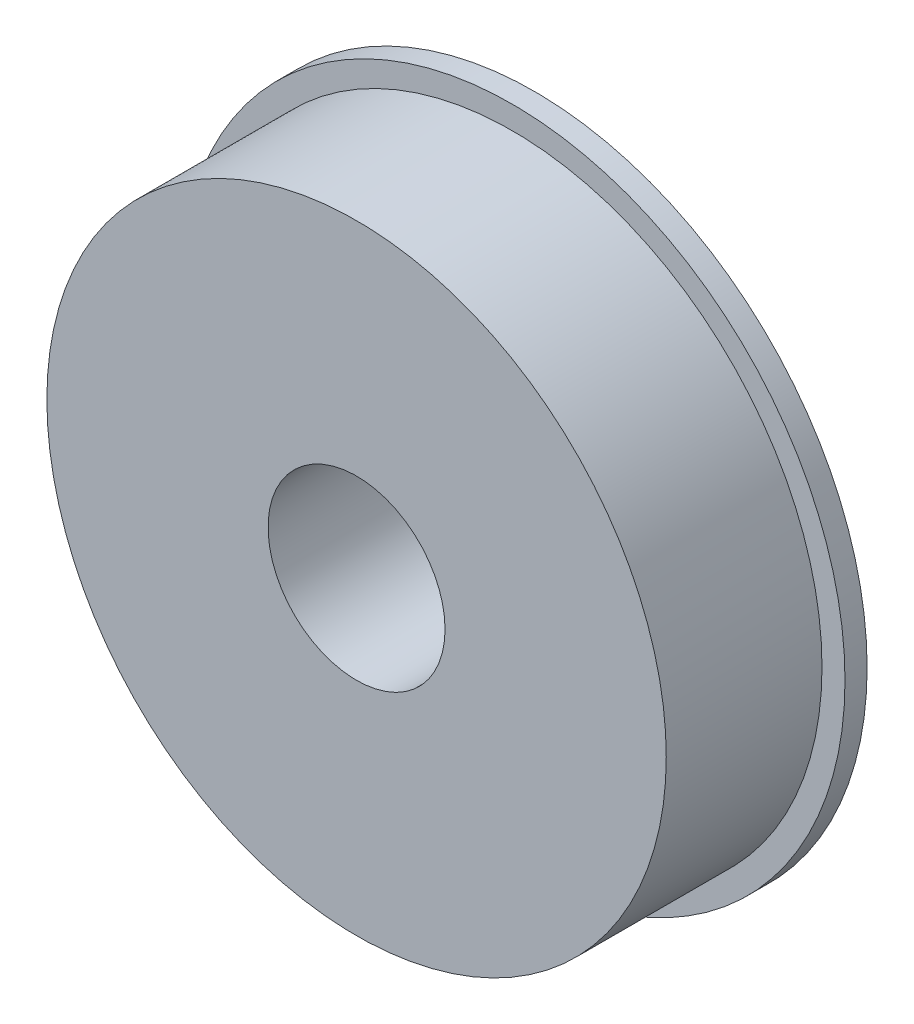
ISO-10303-21;
HEADER;
FILE_DESCRIPTION(('STEP AP214'),'2;1');
FILE_NAME('part.step','',(''),(''),'','','');
FILE_SCHEMA(('AUTOMOTIVE_DESIGN { 1 0 10303 214 1 1 1 1 }'));
ENDSEC;
DATA;
#1=APPLICATION_CONTEXT('core data for automotive mechanical design processes');
#2=APPLICATION_PROTOCOL_DEFINITION('international standard','automotive_design',2000,#1);
#3=PRODUCT_CONTEXT('',#1,'mechanical');
#4=PRODUCT('Part','Part','',(#3));
#5=PRODUCT_RELATED_PRODUCT_CATEGORY('part','',(#4));
#6=PRODUCT_DEFINITION_FORMATION('','',#4);
#7=PRODUCT_DEFINITION_CONTEXT('part definition',#1,'design');
#8=PRODUCT_DEFINITION('design','',#6,#7);
#9=PRODUCT_DEFINITION_SHAPE('','',#8);
#10=(LENGTH_UNIT() NAMED_UNIT(*) SI_UNIT(.MILLI.,.METRE.));
#11=(NAMED_UNIT(*) PLANE_ANGLE_UNIT() SI_UNIT($,.RADIAN.));
#12=(NAMED_UNIT(*) SI_UNIT($,.STERADIAN.) SOLID_ANGLE_UNIT());
#13=UNCERTAINTY_MEASURE_WITH_UNIT(LENGTH_MEASURE(1.E-05),#10,'distance_accuracy_value','');
#14=(GEOMETRIC_REPRESENTATION_CONTEXT(3) GLOBAL_UNCERTAINTY_ASSIGNED_CONTEXT((#13)) GLOBAL_UNIT_ASSIGNED_CONTEXT((#10,
#11,#12)) REPRESENTATION_CONTEXT('',''));
#15=CARTESIAN_POINT('',(0.,0.,0.));
#16=DIRECTION('',(0.,0.,1.));
#17=DIRECTION('',(1.,0.,0.));
#18=AXIS2_PLACEMENT_3D('',#15,#16,#17);
#19=CARTESIAN_POINT('',(0.,0.,1.5875));
#20=DIRECTION('',(0.,0.,1.));
#21=DIRECTION('',(1.,0.,0.));
#22=AXIS2_PLACEMENT_3D('',#19,#20,#21);
#23=PLANE('',#22);
#24=CARTESIAN_POINT('',(0.,0.,1.5875));
#25=DIRECTION('',(0.,0.,1.));
#26=DIRECTION('',(1.,0.,0.));
#27=AXIS2_PLACEMENT_3D('',#24,#25,#26);
#28=CIRCLE('',#27,23.876);
#29=CARTESIAN_POINT('',(23.876,0.,1.5875));
#30=VERTEX_POINT('',#29);
#31=EDGE_CURVE('E10',#30,#30,#28,.T.);
#32=ORIENTED_EDGE('',*,*,#31,.T.);
#33=EDGE_LOOP('',(#32));
#34=FACE_BOUND('',#33,.T.);
#35=CARTESIAN_POINT('',(0.,0.,1.5875));
#36=DIRECTION('',(0.,0.,1.));
#37=DIRECTION('',(1.,0.,0.));
#38=AXIS2_PLACEMENT_3D('',#35,#36,#37);
#39=CIRCLE('',#38,22.225);
#40=CARTESIAN_POINT('',(22.225,0.,1.5875));
#41=VERTEX_POINT('',#40);
#42=EDGE_CURVE('E44',#41,#41,#39,.T.);
#43=ORIENTED_EDGE('',*,*,#42,.F.);
#44=EDGE_LOOP('',(#43));
#45=FACE_BOUND('',#44,.T.);
#46=ADVANCED_FACE('F31',(#34,#45),#23,.T.);
#47=CARTESIAN_POINT('',(0.,0.,1.5875));
#48=DIRECTION('',(0.,0.,-1.));
#49=DIRECTION('',(-1.,0.,0.));
#50=AXIS2_PLACEMENT_3D('',#47,#48,#49);
#51=CYLINDRICAL_SURFACE('',#50,23.876);
#52=ORIENTED_EDGE('',*,*,#31,.F.);
#53=EDGE_LOOP('',(#52));
#54=FACE_BOUND('',#53,.T.);
#55=CARTESIAN_POINT('',(0.,0.,0.));
#56=DIRECTION('',(0.,0.,1.));
#57=DIRECTION('',(1.,0.,0.));
#58=AXIS2_PLACEMENT_3D('',#55,#56,#57);
#59=CIRCLE('',#58,23.876);
#60=CARTESIAN_POINT('',(23.876,0.,0.));
#61=VERTEX_POINT('',#60);
#62=EDGE_CURVE('E35',#61,#61,#59,.T.);
#63=ORIENTED_EDGE('',*,*,#62,.T.);
#64=EDGE_LOOP('',(#63));
#65=FACE_BOUND('',#64,.T.);
#66=ADVANCED_FACE('F33',(#54,#65),#51,.T.);
#67=CARTESIAN_POINT('',(0.,0.,0.));
#68=DIRECTION('',(0.,0.,1.));
#69=DIRECTION('',(1.,0.,0.));
#70=AXIS2_PLACEMENT_3D('',#67,#68,#69);
#71=PLANE('',#70);
#72=ORIENTED_EDGE('',*,*,#62,.F.);
#73=EDGE_LOOP('',(#72));
#74=FACE_BOUND('',#73,.T.);
#75=ADVANCED_FACE('F73',(#74),#71,.F.);
#76=CARTESIAN_POINT('',(0.,0.,12.7635));
#77=DIRECTION('',(0.,0.,-1.));
#78=DIRECTION('',(-1.,0.,0.));
#79=AXIS2_PLACEMENT_3D('',#76,#77,#78);
#80=CYLINDRICAL_SURFACE('',#79,22.225);
#81=CARTESIAN_POINT('',(0.,0.,12.7635));
#82=DIRECTION('',(0.,0.,1.));
#83=DIRECTION('',(1.,0.,0.));
#84=AXIS2_PLACEMENT_3D('',#81,#82,#83);
#85=CIRCLE('',#84,22.225);
#86=CARTESIAN_POINT('',(22.225,0.,12.7635));
#87=VERTEX_POINT('',#86);
#88=EDGE_CURVE('E42',#87,#87,#85,.T.);
#89=ORIENTED_EDGE('',*,*,#88,.F.);
#90=EDGE_LOOP('',(#89));
#91=FACE_BOUND('',#90,.T.);
#92=ORIENTED_EDGE('',*,*,#42,.T.);
#93=EDGE_LOOP('',(#92));
#94=FACE_BOUND('',#93,.T.);
#95=ADVANCED_FACE('F67',(#91,#94),#80,.T.);
#96=CARTESIAN_POINT('',(0.,0.,12.7635));
#97=DIRECTION('',(0.,0.,1.));
#98=DIRECTION('',(1.,0.,0.));
#99=AXIS2_PLACEMENT_3D('',#96,#97,#98);
#100=PLANE('',#99);
#101=CARTESIAN_POINT('',(0.,0.,12.7635));
#102=DIRECTION('',(0.,0.,1.));
#103=DIRECTION('',(1.,0.,0.));
#104=AXIS2_PLACEMENT_3D('',#101,#102,#103);
#105=CIRCLE('',#104,6.35);
#106=CARTESIAN_POINT('',(6.35,0.,12.7635));
#107=VERTEX_POINT('',#106);
#108=EDGE_CURVE('E50',#107,#107,#105,.T.);
#109=ORIENTED_EDGE('',*,*,#108,.F.);
#110=EDGE_LOOP('',(#109));
#111=FACE_BOUND('',#110,.T.);
#112=ORIENTED_EDGE('',*,*,#88,.T.);
#113=EDGE_LOOP('',(#112));
#114=FACE_BOUND('',#113,.T.);
#115=ADVANCED_FACE('F61',(#111,#114),#100,.T.);
#116=CARTESIAN_POINT('',(0.,0.,2.09550000000001));
#117=DIRECTION('',(0.,0.,1.));
#118=DIRECTION('',(1.,0.,0.));
#119=AXIS2_PLACEMENT_3D('',#116,#117,#118);
#120=CYLINDRICAL_SURFACE('',#119,6.35);
#121=CARTESIAN_POINT('',(0.,0.,2.09550000000001));
#122=DIRECTION('',(0.,0.,1.));
#123=DIRECTION('',(1.,0.,0.));
#124=AXIS2_PLACEMENT_3D('',#121,#122,#123);
#125=CIRCLE('',#124,6.35);
#126=CARTESIAN_POINT('',(6.35,0.,2.09550000000001));
#127=VERTEX_POINT('',#126);
#128=EDGE_CURVE('E47',#127,#127,#125,.T.);
#129=ORIENTED_EDGE('',*,*,#128,.F.);
#130=EDGE_LOOP('',(#129));
#131=FACE_BOUND('',#130,.T.);
#132=ORIENTED_EDGE('',*,*,#108,.T.);
#133=EDGE_LOOP('',(#132));
#134=FACE_BOUND('',#133,.T.);
#135=ADVANCED_FACE('F58',(#131,#134),#120,.F.);
#136=CARTESIAN_POINT('',(0.,0.,2.09550000000001));
#137=DIRECTION('',(0.,0.,1.));
#138=DIRECTION('',(1.,0.,0.));
#139=AXIS2_PLACEMENT_3D('',#136,#137,#138);
#140=PLANE('',#139);
#141=ORIENTED_EDGE('',*,*,#128,.T.);
#142=EDGE_LOOP('',(#141));
#143=FACE_BOUND('',#142,.T.);
#144=ADVANCED_FACE('F56',(#143),#140,.T.);
#145=CLOSED_SHELL('',(#46,#66,#75,#95,#115,#135,#144));
#146=MANIFOLD_SOLID_BREP('B2',#145);
#147=ADVANCED_BREP_SHAPE_REPRESENTATION('',(#18,#146),#14);
#148=SHAPE_DEFINITION_REPRESENTATION(#9,#147);
ENDSEC;
END-ISO-10303-21;
